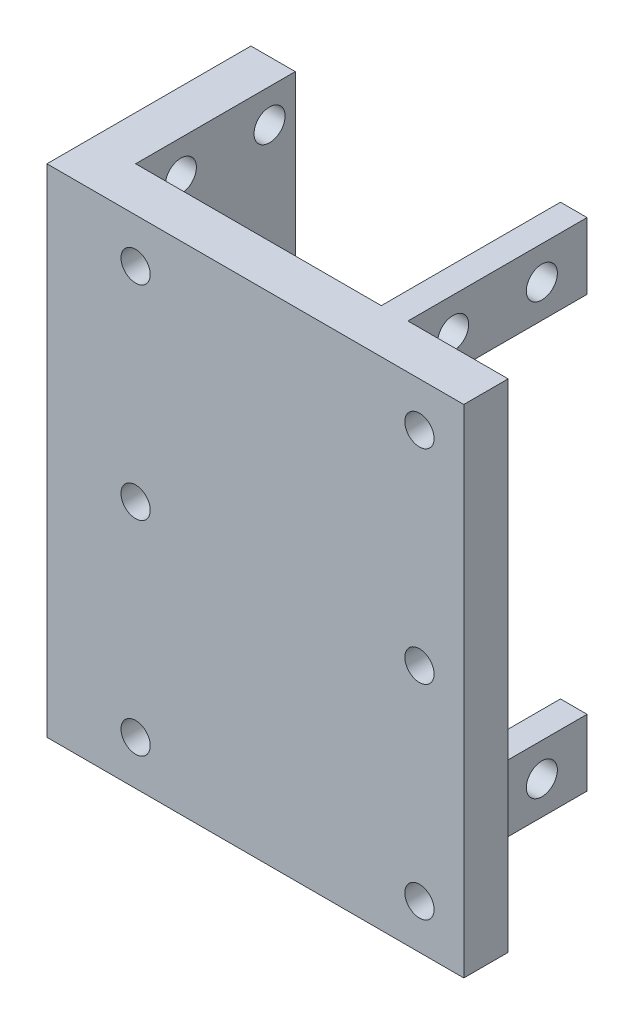
ISO-10303-21;
HEADER;
FILE_DESCRIPTION(('STEP AP214'),'2;1');
FILE_NAME('part.step','',(''),(''),'','','');
FILE_SCHEMA(('AUTOMOTIVE_DESIGN { 1 0 10303 214 1 1 1 1 }'));
ENDSEC;
DATA;
#1=APPLICATION_CONTEXT('core data for automotive mechanical design processes');
#2=APPLICATION_PROTOCOL_DEFINITION('international standard','automotive_design',2000,#1);
#3=PRODUCT_CONTEXT('',#1,'mechanical');
#4=PRODUCT('Part','Part','',(#3));
#5=PRODUCT_RELATED_PRODUCT_CATEGORY('part','',(#4));
#6=PRODUCT_DEFINITION_FORMATION('','',#4);
#7=PRODUCT_DEFINITION_CONTEXT('part definition',#1,'design');
#8=PRODUCT_DEFINITION('design','',#6,#7);
#9=PRODUCT_DEFINITION_SHAPE('','',#8);
#10=(LENGTH_UNIT() NAMED_UNIT(*) SI_UNIT(.MILLI.,.METRE.));
#11=(NAMED_UNIT(*) PLANE_ANGLE_UNIT() SI_UNIT($,.RADIAN.));
#12=(NAMED_UNIT(*) SI_UNIT($,.STERADIAN.) SOLID_ANGLE_UNIT());
#13=UNCERTAINTY_MEASURE_WITH_UNIT(LENGTH_MEASURE(1.E-05),#10,'distance_accuracy_value','');
#14=(GEOMETRIC_REPRESENTATION_CONTEXT(3) GLOBAL_UNCERTAINTY_ASSIGNED_CONTEXT((#13)) GLOBAL_UNIT_ASSIGNED_CONTEXT((#10,
#11,#12)) REPRESENTATION_CONTEXT('',''));
#15=CARTESIAN_POINT('',(0.,0.,0.));
#16=DIRECTION('',(0.,0.,1.));
#17=DIRECTION('',(1.,0.,0.));
#18=AXIS2_PLACEMENT_3D('',#15,#16,#17);
#19=CARTESIAN_POINT('',(0.,0.,0.));
#20=DIRECTION('',(0.,0.,-1.));
#21=DIRECTION('',(-1.,0.,0.));
#22=AXIS2_PLACEMENT_3D('',#19,#20,#21);
#23=PLANE('',#22);
#24=CARTESIAN_POINT('',(16.,-23.,0.));
#25=DIRECTION('',(0.,0.,-1.));
#26=DIRECTION('',(1.,0.,0.));
#27=AXIS2_PLACEMENT_3D('',#24,#25,#26);
#28=CIRCLE('',#27,1.65);
#29=CARTESIAN_POINT('',(17.65,-23.,0.));
#30=VERTEX_POINT('',#29);
#31=EDGE_CURVE('E256',#30,#30,#28,.T.);
#32=ORIENTED_EDGE('',*,*,#31,.F.);
#33=EDGE_LOOP('',(#32));
#34=FACE_BOUND('',#33,.T.);
#35=CARTESIAN_POINT('',(-16.,-23.,0.));
#36=DIRECTION('',(0.,0.,-1.));
#37=DIRECTION('',(-1.,0.,0.));
#38=AXIS2_PLACEMENT_3D('',#35,#36,#37);
#39=CIRCLE('',#38,1.65);
#40=CARTESIAN_POINT('',(-17.65,-23.,0.));
#41=VERTEX_POINT('',#40);
#42=EDGE_CURVE('E588',#41,#41,#39,.T.);
#43=ORIENTED_EDGE('',*,*,#42,.F.);
#44=EDGE_LOOP('',(#43));
#45=FACE_BOUND('',#44,.T.);
#46=CARTESIAN_POINT('',(-16.,23.,0.));
#47=DIRECTION('',(0.,0.,-1.));
#48=DIRECTION('',(1.,0.,0.));
#49=AXIS2_PLACEMENT_3D('',#46,#47,#48);
#50=CIRCLE('',#49,1.65);
#51=CARTESIAN_POINT('',(-14.35,23.,0.));
#52=VERTEX_POINT('',#51);
#53=EDGE_CURVE('E591',#52,#52,#50,.T.);
#54=ORIENTED_EDGE('',*,*,#53,.F.);
#55=EDGE_LOOP('',(#54));
#56=FACE_BOUND('',#55,.T.);
#57=CARTESIAN_POINT('',(-16.,0.,0.));
#58=DIRECTION('',(0.,0.,-1.));
#59=DIRECTION('',(-1.,0.,0.));
#60=AXIS2_PLACEMENT_3D('',#57,#58,#59);
#61=CIRCLE('',#60,1.65);
#62=CARTESIAN_POINT('',(-17.65,0.,0.));
#63=VERTEX_POINT('',#62);
#64=EDGE_CURVE('E595',#63,#63,#61,.T.);
#65=ORIENTED_EDGE('',*,*,#64,.F.);
#66=EDGE_LOOP('',(#65));
#67=FACE_BOUND('',#66,.T.);
#68=CARTESIAN_POINT('',(16.,0.,0.));
#69=DIRECTION('',(0.,0.,-1.));
#70=DIRECTION('',(1.,0.,0.));
#71=AXIS2_PLACEMENT_3D('',#68,#69,#70);
#72=CIRCLE('',#71,1.65);
#73=CARTESIAN_POINT('',(17.65,0.,0.));
#74=VERTEX_POINT('',#73);
#75=EDGE_CURVE('E274',#74,#74,#72,.T.);
#76=ORIENTED_EDGE('',*,*,#75,.F.);
#77=EDGE_LOOP('',(#76));
#78=FACE_BOUND('',#77,.T.);
#79=CARTESIAN_POINT('',(16.,23.,0.));
#80=DIRECTION('',(0.,0.,-1.));
#81=DIRECTION('',(-1.,0.,0.));
#82=AXIS2_PLACEMENT_3D('',#79,#80,#81);
#83=CIRCLE('',#82,1.65);
#84=CARTESIAN_POINT('',(14.35,23.,0.));
#85=VERTEX_POINT('',#84);
#86=EDGE_CURVE('E251',#85,#85,#83,.T.);
#87=ORIENTED_EDGE('',*,*,#86,.F.);
#88=EDGE_LOOP('',(#87));
#89=FACE_BOUND('',#88,.T.);
#90=DIRECTION('',(1.,0.,0.));
#91=VECTOR('',#90,1.);
#92=CARTESIAN_POINT('',(9.7,-20.5,0.));
#93=LINE('',#92,#91);
#94=CARTESIAN_POINT('',(6.7,-20.5,0.));
#95=VERTEX_POINT('',#94);
#96=CARTESIAN_POINT('',(9.7,-20.5,0.));
#97=VERTEX_POINT('',#96);
#98=EDGE_CURVE('E317',#95,#97,#93,.T.);
#99=ORIENTED_EDGE('',*,*,#98,.F.);
#100=DIRECTION('',(0.,1.,0.));
#101=VECTOR('',#100,1.);
#102=CARTESIAN_POINT('',(6.7,-20.5,0.));
#103=LINE('',#102,#101);
#104=CARTESIAN_POINT('',(6.7,-28.,0.));
#105=VERTEX_POINT('',#104);
#106=EDGE_CURVE('E312',#105,#95,#103,.T.);
#107=ORIENTED_EDGE('',*,*,#106,.F.);
#108=DIRECTION('',(1.,0.,0.));
#109=VECTOR('',#108,1.);
#110=CARTESIAN_POINT('',(-21.,-28.,0.));
#111=LINE('',#110,#109);
#112=CARTESIAN_POINT('',(-21.,-28.,0.));
#113=VERTEX_POINT('',#112);
#114=EDGE_CURVE('E160',#113,#105,#111,.T.);
#115=ORIENTED_EDGE('',*,*,#114,.F.);
#116=DIRECTION('',(0.,-1.,0.));
#117=VECTOR('',#116,1.);
#118=CARTESIAN_POINT('',(-21.,-28.,0.));
#119=LINE('',#118,#117);
#120=CARTESIAN_POINT('',(-21.,28.,0.));
#121=VERTEX_POINT('',#120);
#122=EDGE_CURVE('E230',#121,#113,#119,.T.);
#123=ORIENTED_EDGE('',*,*,#122,.F.);
#124=DIRECTION('',(-1.,0.,0.));
#125=VECTOR('',#124,1.);
#126=CARTESIAN_POINT('',(-21.,28.,0.));
#127=LINE('',#126,#125);
#128=CARTESIAN_POINT('',(6.7,28.,0.));
#129=VERTEX_POINT('',#128);
#130=EDGE_CURVE('E226',#129,#121,#127,.T.);
#131=ORIENTED_EDGE('',*,*,#130,.F.);
#132=DIRECTION('',(0.,1.,0.));
#133=VECTOR('',#132,1.);
#134=CARTESIAN_POINT('',(6.7,20.5,0.));
#135=LINE('',#134,#133);
#136=CARTESIAN_POINT('',(6.7,20.5,0.));
#137=VERTEX_POINT('',#136);
#138=EDGE_CURVE('E173',#137,#129,#135,.T.);
#139=ORIENTED_EDGE('',*,*,#138,.F.);
#140=DIRECTION('',(-1.,0.,0.));
#141=VECTOR('',#140,1.);
#142=CARTESIAN_POINT('',(9.7,20.5,0.));
#143=LINE('',#142,#141);
#144=CARTESIAN_POINT('',(9.7,20.5,0.));
#145=VERTEX_POINT('',#144);
#146=EDGE_CURVE('E163',#145,#137,#143,.T.);
#147=ORIENTED_EDGE('',*,*,#146,.F.);
#148=DIRECTION('',(0.,-1.,0.));
#149=VECTOR('',#148,1.);
#150=CARTESIAN_POINT('',(9.7,28.,0.));
#151=LINE('',#150,#149);
#152=CARTESIAN_POINT('',(9.7,28.,0.));
#153=VERTEX_POINT('',#152);
#154=EDGE_CURVE('E161',#153,#145,#151,.T.);
#155=ORIENTED_EDGE('',*,*,#154,.F.);
#156=CARTESIAN_POINT('',(21.,28.,0.));
#157=VERTEX_POINT('',#156);
#158=EDGE_CURVE('E227',#157,#153,#127,.T.);
#159=ORIENTED_EDGE('',*,*,#158,.F.);
#160=DIRECTION('',(0.,1.,0.));
#161=VECTOR('',#160,1.);
#162=CARTESIAN_POINT('',(21.,-28.,0.));
#163=LINE('',#162,#161);
#164=CARTESIAN_POINT('',(21.,-28.,0.));
#165=VERTEX_POINT('',#164);
#166=EDGE_CURVE('E208',#165,#157,#163,.T.);
#167=ORIENTED_EDGE('',*,*,#166,.F.);
#168=CARTESIAN_POINT('',(9.69999999999999,-28.,0.));
#169=VERTEX_POINT('',#168);
#170=EDGE_CURVE('E233',#169,#165,#111,.T.);
#171=ORIENTED_EDGE('',*,*,#170,.F.);
#172=DIRECTION('',(0.,-1.,0.));
#173=VECTOR('',#172,1.);
#174=CARTESIAN_POINT('',(9.7,-28.,0.));
#175=LINE('',#174,#173);
#176=EDGE_CURVE('E155',#97,#169,#175,.T.);
#177=ORIENTED_EDGE('',*,*,#176,.F.);
#178=EDGE_LOOP('',(#99,#107,#115,#123,#131,#139,#147,#155,#159,#167,#171,#177));
#179=FACE_BOUND('',#178,.T.);
#180=ADVANCED_FACE('F35',(#34,#45,#56,#67,#78,#89,#179),#23,.T.);
#181=CARTESIAN_POINT('',(21.,-28.,5.));
#182=DIRECTION('',(-1.,0.,0.));
#183=DIRECTION('',(0.,0.,1.));
#184=AXIS2_PLACEMENT_3D('',#181,#182,#183);
#185=PLANE('',#184);
#186=ORIENTED_EDGE('',*,*,#166,.T.);
#187=DIRECTION('',(0.,0.,-1.));
#188=VECTOR('',#187,1.);
#189=CARTESIAN_POINT('',(21.,28.,5.));
#190=LINE('',#189,#188);
#191=CARTESIAN_POINT('',(21.,28.,5.));
#192=VERTEX_POINT('',#191);
#193=EDGE_CURVE('E11',#192,#157,#190,.T.);
#194=ORIENTED_EDGE('',*,*,#193,.F.);
#195=DIRECTION('',(0.,1.,0.));
#196=VECTOR('',#195,1.);
#197=CARTESIAN_POINT('',(21.,-28.,5.));
#198=LINE('',#197,#196);
#199=CARTESIAN_POINT('',(21.,-28.,5.));
#200=VERTEX_POINT('',#199);
#201=EDGE_CURVE('E217',#200,#192,#198,.T.);
#202=ORIENTED_EDGE('',*,*,#201,.F.);
#203=DIRECTION('',(0.,0.,-1.));
#204=VECTOR('',#203,1.);
#205=CARTESIAN_POINT('',(21.,-28.,5.));
#206=LINE('',#205,#204);
#207=EDGE_CURVE('E44',#200,#165,#206,.T.);
#208=ORIENTED_EDGE('',*,*,#207,.T.);
#209=EDGE_LOOP('',(#186,#194,#202,#208));
#210=FACE_BOUND('',#209,.T.);
#211=ADVANCED_FACE('F37',(#210),#185,.F.);
#212=CARTESIAN_POINT('',(-21.,28.,5.));
#213=DIRECTION('',(0.,-1.,0.));
#214=DIRECTION('',(0.,0.,-1.));
#215=AXIS2_PLACEMENT_3D('',#212,#213,#214);
#216=PLANE('',#215);
#217=ORIENTED_EDGE('',*,*,#158,.T.);
#218=DIRECTION('',(0.,0.,1.));
#219=VECTOR('',#218,1.);
#220=CARTESIAN_POINT('',(9.7,28.,-20.2));
#221=LINE('',#220,#219);
#222=CARTESIAN_POINT('',(9.7,28.,-20.2));
#223=VERTEX_POINT('',#222);
#224=EDGE_CURVE('E188',#223,#153,#221,.T.);
#225=ORIENTED_EDGE('',*,*,#224,.F.);
#226=DIRECTION('',(1.,0.,0.));
#227=VECTOR('',#226,1.);
#228=CARTESIAN_POINT('',(6.7,28.,-20.2));
#229=LINE('',#228,#227);
#230=CARTESIAN_POINT('',(6.7,28.,-20.2));
#231=VERTEX_POINT('',#230);
#232=EDGE_CURVE('E169',#231,#223,#229,.T.);
#233=ORIENTED_EDGE('',*,*,#232,.F.);
#234=DIRECTION('',(0.,0.,1.));
#235=VECTOR('',#234,1.);
#236=CARTESIAN_POINT('',(6.7,28.,-20.2));
#237=LINE('',#236,#235);
#238=EDGE_CURVE('E178',#231,#129,#237,.T.);
#239=ORIENTED_EDGE('',*,*,#238,.T.);
#240=ORIENTED_EDGE('',*,*,#130,.T.);
#241=DIRECTION('',(0.,0.,1.));
#242=VECTOR('',#241,1.);
#243=CARTESIAN_POINT('',(-21.,28.,-18.));
#244=LINE('',#243,#242);
#245=CARTESIAN_POINT('',(-21.,28.,-18.));
#246=VERTEX_POINT('',#245);
#247=EDGE_CURVE('E203',#246,#121,#244,.T.);
#248=ORIENTED_EDGE('',*,*,#247,.F.);
#249=DIRECTION('',(-1.,0.,0.));
#250=VECTOR('',#249,1.);
#251=CARTESIAN_POINT('',(-26.,28.,-18.));
#252=LINE('',#251,#250);
#253=CARTESIAN_POINT('',(-26.,28.,-18.));
#254=VERTEX_POINT('',#253);
#255=EDGE_CURVE('E194',#246,#254,#252,.T.);
#256=ORIENTED_EDGE('',*,*,#255,.T.);
#257=DIRECTION('',(0.,0.,1.));
#258=VECTOR('',#257,1.);
#259=CARTESIAN_POINT('',(-26.,28.,-18.));
#260=LINE('',#259,#258);
#261=CARTESIAN_POINT('',(-26.,28.,5.));
#262=VERTEX_POINT('',#261);
#263=EDGE_CURVE('E212',#254,#262,#260,.T.);
#264=ORIENTED_EDGE('',*,*,#263,.T.);
#265=DIRECTION('',(-1.,0.,0.));
#266=VECTOR('',#265,1.);
#267=CARTESIAN_POINT('',(-21.,28.,5.));
#268=LINE('',#267,#266);
#269=EDGE_CURVE('E220',#192,#262,#268,.T.);
#270=ORIENTED_EDGE('',*,*,#269,.F.);
#271=ORIENTED_EDGE('',*,*,#193,.T.);
#272=EDGE_LOOP('',(#217,#225,#233,#239,#240,#248,#256,#264,#270,#271));
#273=FACE_BOUND('',#272,.T.);
#274=ADVANCED_FACE('F368',(#273),#216,.F.);
#275=CARTESIAN_POINT('',(-21.,-28.,5.));
#276=DIRECTION('',(0.,1.,0.));
#277=DIRECTION('',(0.,0.,1.));
#278=AXIS2_PLACEMENT_3D('',#275,#276,#277);
#279=PLANE('',#278);
#280=ORIENTED_EDGE('',*,*,#114,.T.);
#281=DIRECTION('',(0.,0.,1.));
#282=VECTOR('',#281,1.);
#283=CARTESIAN_POINT('',(6.7,-28.,-20.2));
#284=LINE('',#283,#282);
#285=CARTESIAN_POINT('',(6.7,-28.,-20.2));
#286=VERTEX_POINT('',#285);
#287=EDGE_CURVE('E143',#286,#105,#284,.T.);
#288=ORIENTED_EDGE('',*,*,#287,.F.);
#289=DIRECTION('',(-1.,0.,0.));
#290=VECTOR('',#289,1.);
#291=CARTESIAN_POINT('',(6.7,-28.,-20.2));
#292=LINE('',#291,#290);
#293=CARTESIAN_POINT('',(9.7,-28.,-20.2));
#294=VERTEX_POINT('',#293);
#295=EDGE_CURVE('E150',#294,#286,#292,.T.);
#296=ORIENTED_EDGE('',*,*,#295,.F.);
#297=DIRECTION('',(0.,0.,1.));
#298=VECTOR('',#297,1.);
#299=CARTESIAN_POINT('',(9.7,-28.,-20.2));
#300=LINE('',#299,#298);
#301=EDGE_CURVE('E52',#294,#169,#300,.T.);
#302=ORIENTED_EDGE('',*,*,#301,.T.);
#303=ORIENTED_EDGE('',*,*,#170,.T.);
#304=ORIENTED_EDGE('',*,*,#207,.F.);
#305=DIRECTION('',(1.,0.,0.));
#306=VECTOR('',#305,1.);
#307=CARTESIAN_POINT('',(-21.,-28.,5.));
#308=LINE('',#307,#306);
#309=CARTESIAN_POINT('',(-26.,-28.,5.));
#310=VERTEX_POINT('',#309);
#311=EDGE_CURVE('E222',#310,#200,#308,.T.);
#312=ORIENTED_EDGE('',*,*,#311,.F.);
#313=DIRECTION('',(0.,0.,1.));
#314=VECTOR('',#313,1.);
#315=CARTESIAN_POINT('',(-26.,-28.,-18.));
#316=LINE('',#315,#314);
#317=CARTESIAN_POINT('',(-26.,-28.,-18.));
#318=VERTEX_POINT('',#317);
#319=EDGE_CURVE('E209',#318,#310,#316,.T.);
#320=ORIENTED_EDGE('',*,*,#319,.F.);
#321=DIRECTION('',(1.,0.,0.));
#322=VECTOR('',#321,1.);
#323=CARTESIAN_POINT('',(-26.,-28.,-18.));
#324=LINE('',#323,#322);
#325=CARTESIAN_POINT('',(-21.,-28.,-18.));
#326=VERTEX_POINT('',#325);
#327=EDGE_CURVE('E200',#318,#326,#324,.T.);
#328=ORIENTED_EDGE('',*,*,#327,.T.);
#329=DIRECTION('',(0.,0.,1.));
#330=VECTOR('',#329,1.);
#331=CARTESIAN_POINT('',(-21.,-28.,-18.));
#332=LINE('',#331,#330);
#333=EDGE_CURVE('E206',#326,#113,#332,.T.);
#334=ORIENTED_EDGE('',*,*,#333,.T.);
#335=EDGE_LOOP('',(#280,#288,#296,#302,#303,#304,#312,#320,#328,#334));
#336=FACE_BOUND('',#335,.T.);
#337=ADVANCED_FACE('F158',(#336),#279,.F.);
#338=CARTESIAN_POINT('',(0.,0.,5.));
#339=DIRECTION('',(0.,0.,-1.));
#340=DIRECTION('',(-1.,0.,0.));
#341=AXIS2_PLACEMENT_3D('',#338,#339,#340);
#342=PLANE('',#341);
#343=CARTESIAN_POINT('',(16.,-23.,5.));
#344=DIRECTION('',(0.,0.,-1.));
#345=DIRECTION('',(-1.,0.,0.));
#346=AXIS2_PLACEMENT_3D('',#343,#344,#345);
#347=CIRCLE('',#346,1.65);
#348=CARTESIAN_POINT('',(14.35,-23.,5.));
#349=VERTEX_POINT('',#348);
#350=EDGE_CURVE('E39',#349,#349,#347,.T.);
#351=ORIENTED_EDGE('',*,*,#350,.T.);
#352=EDGE_LOOP('',(#351));
#353=FACE_BOUND('',#352,.T.);
#354=CARTESIAN_POINT('',(-16.,-23.,5.));
#355=DIRECTION('',(0.,0.,-1.));
#356=DIRECTION('',(-1.,0.,0.));
#357=AXIS2_PLACEMENT_3D('',#354,#355,#356);
#358=CIRCLE('',#357,1.65);
#359=CARTESIAN_POINT('',(-17.65,-23.,5.));
#360=VERTEX_POINT('',#359);
#361=EDGE_CURVE('E261',#360,#360,#358,.T.);
#362=ORIENTED_EDGE('',*,*,#361,.T.);
#363=EDGE_LOOP('',(#362));
#364=FACE_BOUND('',#363,.T.);
#365=CARTESIAN_POINT('',(-16.,23.,5.));
#366=DIRECTION('',(0.,0.,-1.));
#367=DIRECTION('',(-1.,0.,0.));
#368=AXIS2_PLACEMENT_3D('',#365,#366,#367);
#369=CIRCLE('',#368,1.65);
#370=CARTESIAN_POINT('',(-17.65,23.,5.));
#371=VERTEX_POINT('',#370);
#372=EDGE_CURVE('E259',#371,#371,#369,.T.);
#373=ORIENTED_EDGE('',*,*,#372,.T.);
#374=EDGE_LOOP('',(#373));
#375=FACE_BOUND('',#374,.T.);
#376=CARTESIAN_POINT('',(-16.,0.,5.));
#377=DIRECTION('',(0.,0.,-1.));
#378=DIRECTION('',(-1.,0.,0.));
#379=AXIS2_PLACEMENT_3D('',#376,#377,#378);
#380=CIRCLE('',#379,1.65);
#381=CARTESIAN_POINT('',(-17.65,0.,5.));
#382=VERTEX_POINT('',#381);
#383=EDGE_CURVE('E255',#382,#382,#380,.T.);
#384=ORIENTED_EDGE('',*,*,#383,.T.);
#385=EDGE_LOOP('',(#384));
#386=FACE_BOUND('',#385,.T.);
#387=CARTESIAN_POINT('',(16.,0.,5.));
#388=DIRECTION('',(0.,0.,-1.));
#389=DIRECTION('',(-1.,0.,0.));
#390=AXIS2_PLACEMENT_3D('',#387,#388,#389);
#391=CIRCLE('',#390,1.65);
#392=CARTESIAN_POINT('',(14.35,0.,5.));
#393=VERTEX_POINT('',#392);
#394=EDGE_CURVE('E252',#393,#393,#391,.T.);
#395=ORIENTED_EDGE('',*,*,#394,.T.);
#396=EDGE_LOOP('',(#395));
#397=FACE_BOUND('',#396,.T.);
#398=CARTESIAN_POINT('',(16.,23.,5.));
#399=DIRECTION('',(0.,0.,-1.));
#400=DIRECTION('',(-1.,0.,0.));
#401=AXIS2_PLACEMENT_3D('',#398,#399,#400);
#402=CIRCLE('',#401,1.65);
#403=CARTESIAN_POINT('',(14.35,23.,5.));
#404=VERTEX_POINT('',#403);
#405=EDGE_CURVE('E247',#404,#404,#402,.T.);
#406=ORIENTED_EDGE('',*,*,#405,.T.);
#407=EDGE_LOOP('',(#406));
#408=FACE_BOUND('',#407,.T.);
#409=ORIENTED_EDGE('',*,*,#201,.T.);
#410=ORIENTED_EDGE('',*,*,#269,.T.);
#411=DIRECTION('',(0.,-1.,0.));
#412=VECTOR('',#411,1.);
#413=CARTESIAN_POINT('',(-26.,-28.,5.));
#414=LINE('',#413,#412);
#415=EDGE_CURVE('E190',#262,#310,#414,.T.);
#416=ORIENTED_EDGE('',*,*,#415,.T.);
#417=ORIENTED_EDGE('',*,*,#311,.T.);
#418=EDGE_LOOP('',(#409,#410,#416,#417));
#419=FACE_BOUND('',#418,.T.);
#420=ADVANCED_FACE('F335',(#353,#364,#375,#386,#397,#408,#419),#342,.F.);
#421=CARTESIAN_POINT('',(-21.,-28.,-18.));
#422=DIRECTION('',(1.,0.,0.));
#423=DIRECTION('',(0.,0.,-1.));
#424=AXIS2_PLACEMENT_3D('',#421,#422,#423);
#425=PLANE('',#424);
#426=CARTESIAN_POINT('',(-21.,24.25,-15.1));
#427=DIRECTION('',(1.,0.,0.));
#428=DIRECTION('',(0.,0.,-1.));
#429=AXIS2_PLACEMENT_3D('',#426,#427,#428);
#430=CIRCLE('',#429,1.75);
#431=CARTESIAN_POINT('',(-21.,24.25,-16.85));
#432=VERTEX_POINT('',#431);
#433=EDGE_CURVE('E245',#432,#432,#430,.T.);
#434=ORIENTED_EDGE('',*,*,#433,.F.);
#435=EDGE_LOOP('',(#434));
#436=FACE_BOUND('',#435,.T.);
#437=CARTESIAN_POINT('',(-21.,-24.25,-15.1));
#438=DIRECTION('',(1.,0.,0.));
#439=DIRECTION('',(0.,0.,-1.));
#440=AXIS2_PLACEMENT_3D('',#437,#438,#439);
#441=CIRCLE('',#440,1.75);
#442=CARTESIAN_POINT('',(-21.,-24.25,-16.85));
#443=VERTEX_POINT('',#442);
#444=EDGE_CURVE('E246',#443,#443,#441,.T.);
#445=ORIENTED_EDGE('',*,*,#444,.F.);
#446=EDGE_LOOP('',(#445));
#447=FACE_BOUND('',#446,.T.);
#448=CARTESIAN_POINT('',(-21.,-24.25,-5.1));
#449=DIRECTION('',(1.,0.,0.));
#450=DIRECTION('',(0.,0.,-1.));
#451=AXIS2_PLACEMENT_3D('',#448,#449,#450);
#452=CIRCLE('',#451,1.75);
#453=CARTESIAN_POINT('',(-21.,-24.25,-6.85));
#454=VERTEX_POINT('',#453);
#455=EDGE_CURVE('E296',#454,#454,#452,.T.);
#456=ORIENTED_EDGE('',*,*,#455,.F.);
#457=EDGE_LOOP('',(#456));
#458=FACE_BOUND('',#457,.T.);
#459=CARTESIAN_POINT('',(-21.,24.25,-5.1));
#460=DIRECTION('',(1.,0.,0.));
#461=DIRECTION('',(0.,0.,-1.));
#462=AXIS2_PLACEMENT_3D('',#459,#460,#461);
#463=CIRCLE('',#462,1.75);
#464=CARTESIAN_POINT('',(-21.,24.25,-6.85));
#465=VERTEX_POINT('',#464);
#466=EDGE_CURVE('E240',#465,#465,#463,.T.);
#467=ORIENTED_EDGE('',*,*,#466,.F.);
#468=EDGE_LOOP('',(#467));
#469=FACE_BOUND('',#468,.T.);
#470=ORIENTED_EDGE('',*,*,#247,.T.);
#471=ORIENTED_EDGE('',*,*,#122,.T.);
#472=ORIENTED_EDGE('',*,*,#333,.F.);
#473=DIRECTION('',(0.,1.,0.));
#474=VECTOR('',#473,1.);
#475=CARTESIAN_POINT('',(-21.,-28.,-18.));
#476=LINE('',#475,#474);
#477=EDGE_CURVE('E191',#326,#246,#476,.T.);
#478=ORIENTED_EDGE('',*,*,#477,.T.);
#479=EDGE_LOOP('',(#470,#471,#472,#478));
#480=FACE_BOUND('',#479,.T.);
#481=ADVANCED_FACE('F346',(#436,#447,#458,#469,#480),#425,.T.);
#482=CARTESIAN_POINT('',(-26.,-28.,-18.));
#483=DIRECTION('',(-1.,0.,0.));
#484=DIRECTION('',(0.,-1.,0.));
#485=AXIS2_PLACEMENT_3D('',#482,#483,#484);
#486=PLANE('',#485);
#487=CARTESIAN_POINT('',(-26.,24.25,-15.1));
#488=DIRECTION('',(1.,0.,0.));
#489=DIRECTION('',(0.,0.,1.));
#490=AXIS2_PLACEMENT_3D('',#487,#488,#489);
#491=CIRCLE('',#490,1.75);
#492=CARTESIAN_POINT('',(-26.,24.25,-13.35));
#493=VERTEX_POINT('',#492);
#494=EDGE_CURVE('E276',#493,#493,#491,.T.);
#495=ORIENTED_EDGE('',*,*,#494,.T.);
#496=EDGE_LOOP('',(#495));
#497=FACE_BOUND('',#496,.T.);
#498=CARTESIAN_POINT('',(-26.,-24.25,-15.1));
#499=DIRECTION('',(1.,0.,0.));
#500=DIRECTION('',(0.,0.,-1.));
#501=AXIS2_PLACEMENT_3D('',#498,#499,#500);
#502=CIRCLE('',#501,1.75);
#503=CARTESIAN_POINT('',(-26.,-24.25,-16.85));
#504=VERTEX_POINT('',#503);
#505=EDGE_CURVE('E283',#504,#504,#502,.T.);
#506=ORIENTED_EDGE('',*,*,#505,.T.);
#507=EDGE_LOOP('',(#506));
#508=FACE_BOUND('',#507,.T.);
#509=CARTESIAN_POINT('',(-26.,-24.25,-5.1));
#510=DIRECTION('',(1.,0.,0.));
#511=DIRECTION('',(0.,0.,1.));
#512=AXIS2_PLACEMENT_3D('',#509,#510,#511);
#513=CIRCLE('',#512,1.75);
#514=CARTESIAN_POINT('',(-26.,-24.25,-3.35));
#515=VERTEX_POINT('',#514);
#516=EDGE_CURVE('E289',#515,#515,#513,.T.);
#517=ORIENTED_EDGE('',*,*,#516,.T.);
#518=EDGE_LOOP('',(#517));
#519=FACE_BOUND('',#518,.T.);
#520=CARTESIAN_POINT('',(-26.,24.25,-5.1));
#521=DIRECTION('',(1.,0.,0.));
#522=DIRECTION('',(0.,0.,-1.));
#523=AXIS2_PLACEMENT_3D('',#520,#521,#522);
#524=CIRCLE('',#523,1.75);
#525=CARTESIAN_POINT('',(-26.,24.25,-6.85));
#526=VERTEX_POINT('',#525);
#527=EDGE_CURVE('E241',#526,#526,#524,.T.);
#528=ORIENTED_EDGE('',*,*,#527,.T.);
#529=EDGE_LOOP('',(#528));
#530=FACE_BOUND('',#529,.T.);
#531=ORIENTED_EDGE('',*,*,#415,.F.);
#532=ORIENTED_EDGE('',*,*,#263,.F.);
#533=DIRECTION('',(0.,-1.,0.));
#534=VECTOR('',#533,1.);
#535=CARTESIAN_POINT('',(-26.,-28.,-18.));
#536=LINE('',#535,#534);
#537=EDGE_CURVE('E197',#254,#318,#536,.T.);
#538=ORIENTED_EDGE('',*,*,#537,.T.);
#539=ORIENTED_EDGE('',*,*,#319,.T.);
#540=EDGE_LOOP('',(#531,#532,#538,#539));
#541=FACE_BOUND('',#540,.T.);
#542=ADVANCED_FACE('F338',(#497,#508,#519,#530,#541),#486,.T.);
#543=CARTESIAN_POINT('',(0.,0.,-18.));
#544=DIRECTION('',(0.,0.,-1.));
#545=DIRECTION('',(-1.,0.,0.));
#546=AXIS2_PLACEMENT_3D('',#543,#544,#545);
#547=PLANE('',#546);
#548=ORIENTED_EDGE('',*,*,#477,.F.);
#549=ORIENTED_EDGE('',*,*,#327,.F.);
#550=ORIENTED_EDGE('',*,*,#537,.F.);
#551=ORIENTED_EDGE('',*,*,#255,.F.);
#552=EDGE_LOOP('',(#548,#549,#550,#551));
#553=FACE_BOUND('',#552,.T.);
#554=ADVANCED_FACE('F344',(#553),#547,.T.);
#555=CARTESIAN_POINT('',(9.7,28.,-20.2));
#556=DIRECTION('',(-1.,0.,0.));
#557=DIRECTION('',(0.,-1.,0.));
#558=AXIS2_PLACEMENT_3D('',#555,#556,#557);
#559=PLANE('',#558);
#560=CARTESIAN_POINT('',(9.69999999999999,24.25,-15.1));
#561=DIRECTION('',(1.,0.,0.));
#562=DIRECTION('',(0.,0.,1.));
#563=AXIS2_PLACEMENT_3D('',#560,#561,#562);
#564=CIRCLE('',#563,1.75);
#565=CARTESIAN_POINT('',(9.69999999999999,24.25,-13.35));
#566=VERTEX_POINT('',#565);
#567=EDGE_CURVE('E280',#566,#566,#564,.T.);
#568=ORIENTED_EDGE('',*,*,#567,.F.);
#569=EDGE_LOOP('',(#568));
#570=FACE_BOUND('',#569,.T.);
#571=CARTESIAN_POINT('',(9.69999999999999,24.25,-5.1));
#572=DIRECTION('',(1.,0.,0.));
#573=DIRECTION('',(0.,0.,-1.));
#574=AXIS2_PLACEMENT_3D('',#571,#572,#573);
#575=CIRCLE('',#574,1.75);
#576=CARTESIAN_POINT('',(9.69999999999999,24.25,-6.85));
#577=VERTEX_POINT('',#576);
#578=EDGE_CURVE('E306',#577,#577,#575,.T.);
#579=ORIENTED_EDGE('',*,*,#578,.F.);
#580=EDGE_LOOP('',(#579));
#581=FACE_BOUND('',#580,.T.);
#582=ORIENTED_EDGE('',*,*,#154,.T.);
#583=DIRECTION('',(0.,0.,1.));
#584=VECTOR('',#583,1.);
#585=CARTESIAN_POINT('',(9.7,20.5,-20.2));
#586=LINE('',#585,#584);
#587=CARTESIAN_POINT('',(9.7,20.5,-20.2));
#588=VERTEX_POINT('',#587);
#589=EDGE_CURVE('E185',#588,#145,#586,.T.);
#590=ORIENTED_EDGE('',*,*,#589,.F.);
#591=DIRECTION('',(0.,-1.,0.));
#592=VECTOR('',#591,1.);
#593=CARTESIAN_POINT('',(9.7,28.,-20.2));
#594=LINE('',#593,#592);
#595=EDGE_CURVE('E172',#223,#588,#594,.T.);
#596=ORIENTED_EDGE('',*,*,#595,.F.);
#597=ORIENTED_EDGE('',*,*,#224,.T.);
#598=EDGE_LOOP('',(#582,#590,#596,#597));
#599=FACE_BOUND('',#598,.T.);
#600=ADVANCED_FACE('F385',(#570,#581,#599),#559,.F.);
#601=CARTESIAN_POINT('',(9.7,20.5,-20.2));
#602=DIRECTION('',(0.,1.,0.));
#603=DIRECTION('',(0.,0.,1.));
#604=AXIS2_PLACEMENT_3D('',#601,#602,#603);
#605=PLANE('',#604);
#606=ORIENTED_EDGE('',*,*,#146,.T.);
#607=DIRECTION('',(0.,0.,1.));
#608=VECTOR('',#607,1.);
#609=CARTESIAN_POINT('',(6.7,20.5,-20.2));
#610=LINE('',#609,#608);
#611=CARTESIAN_POINT('',(6.7,20.5,-20.2));
#612=VERTEX_POINT('',#611);
#613=EDGE_CURVE('E60',#612,#137,#610,.T.);
#614=ORIENTED_EDGE('',*,*,#613,.F.);
#615=DIRECTION('',(-1.,0.,0.));
#616=VECTOR('',#615,1.);
#617=CARTESIAN_POINT('',(9.7,20.5,-20.2));
#618=LINE('',#617,#616);
#619=EDGE_CURVE('E175',#588,#612,#618,.T.);
#620=ORIENTED_EDGE('',*,*,#619,.F.);
#621=ORIENTED_EDGE('',*,*,#589,.T.);
#622=EDGE_LOOP('',(#606,#614,#620,#621));
#623=FACE_BOUND('',#622,.T.);
#624=ADVANCED_FACE('F388',(#623),#605,.F.);
#625=CARTESIAN_POINT('',(6.7,20.5,-20.2));
#626=DIRECTION('',(1.,0.,0.));
#627=DIRECTION('',(0.,1.,0.));
#628=AXIS2_PLACEMENT_3D('',#625,#626,#627);
#629=PLANE('',#628);
#630=CARTESIAN_POINT('',(6.7,24.25,-15.1));
#631=DIRECTION('',(1.,0.,0.));
#632=DIRECTION('',(0.,1.,0.));
#633=AXIS2_PLACEMENT_3D('',#630,#631,#632);
#634=CIRCLE('',#633,1.75);
#635=CARTESIAN_POINT('',(6.7,26.,-15.1));
#636=VERTEX_POINT('',#635);
#637=EDGE_CURVE('E242',#636,#636,#634,.T.);
#638=ORIENTED_EDGE('',*,*,#637,.T.);
#639=EDGE_LOOP('',(#638));
#640=FACE_BOUND('',#639,.T.);
#641=CARTESIAN_POINT('',(6.7,24.25,-5.1));
#642=DIRECTION('',(1.,0.,0.));
#643=DIRECTION('',(0.,1.,0.));
#644=AXIS2_PLACEMENT_3D('',#641,#642,#643);
#645=CIRCLE('',#644,1.75);
#646=CARTESIAN_POINT('',(6.7,26.,-5.1));
#647=VERTEX_POINT('',#646);
#648=EDGE_CURVE('E237',#647,#647,#645,.T.);
#649=ORIENTED_EDGE('',*,*,#648,.T.);
#650=EDGE_LOOP('',(#649));
#651=FACE_BOUND('',#650,.T.);
#652=ORIENTED_EDGE('',*,*,#138,.T.);
#653=ORIENTED_EDGE('',*,*,#238,.F.);
#654=DIRECTION('',(0.,1.,0.));
#655=VECTOR('',#654,1.);
#656=CARTESIAN_POINT('',(6.7,20.5,-20.2));
#657=LINE('',#656,#655);
#658=EDGE_CURVE('E177',#612,#231,#657,.T.);
#659=ORIENTED_EDGE('',*,*,#658,.F.);
#660=ORIENTED_EDGE('',*,*,#613,.T.);
#661=EDGE_LOOP('',(#652,#653,#659,#660));
#662=FACE_BOUND('',#661,.T.);
#663=ADVANCED_FACE('F391',(#640,#651,#662),#629,.F.);
#664=CARTESIAN_POINT('',(0.,0.,-20.2));
#665=DIRECTION('',(0.,0.,-1.));
#666=DIRECTION('',(-1.,0.,0.));
#667=AXIS2_PLACEMENT_3D('',#664,#665,#666);
#668=PLANE('',#667);
#669=ORIENTED_EDGE('',*,*,#232,.T.);
#670=ORIENTED_EDGE('',*,*,#595,.T.);
#671=ORIENTED_EDGE('',*,*,#619,.T.);
#672=ORIENTED_EDGE('',*,*,#658,.T.);
#673=EDGE_LOOP('',(#669,#670,#671,#672));
#674=FACE_BOUND('',#673,.T.);
#675=ADVANCED_FACE('F359',(#674),#668,.T.);
#676=CARTESIAN_POINT('',(6.7,-20.5,-20.2));
#677=DIRECTION('',(1.,0.,0.));
#678=DIRECTION('',(0.,0.,-1.));
#679=AXIS2_PLACEMENT_3D('',#676,#677,#678);
#680=PLANE('',#679);
#681=CARTESIAN_POINT('',(6.7,-24.25,-15.1));
#682=DIRECTION('',(1.,0.,0.));
#683=DIRECTION('',(0.,0.,-1.));
#684=AXIS2_PLACEMENT_3D('',#681,#682,#683);
#685=CIRCLE('',#684,1.75);
#686=CARTESIAN_POINT('',(6.7,-24.25,-16.85));
#687=VERTEX_POINT('',#686);
#688=EDGE_CURVE('E299',#687,#687,#685,.T.);
#689=ORIENTED_EDGE('',*,*,#688,.T.);
#690=EDGE_LOOP('',(#689));
#691=FACE_BOUND('',#690,.T.);
#692=CARTESIAN_POINT('',(6.7,-24.25,-5.1));
#693=DIRECTION('',(1.,0.,0.));
#694=DIRECTION('',(0.,0.,-1.));
#695=AXIS2_PLACEMENT_3D('',#692,#693,#694);
#696=CIRCLE('',#695,1.75);
#697=CARTESIAN_POINT('',(6.7,-24.25,-6.85));
#698=VERTEX_POINT('',#697);
#699=EDGE_CURVE('E279',#698,#698,#696,.T.);
#700=ORIENTED_EDGE('',*,*,#699,.T.);
#701=EDGE_LOOP('',(#700));
#702=FACE_BOUND('',#701,.T.);
#703=ORIENTED_EDGE('',*,*,#106,.T.);
#704=DIRECTION('',(0.,0.,1.));
#705=VECTOR('',#704,1.);
#706=CARTESIAN_POINT('',(6.7,-20.5,-20.2));
#707=LINE('',#706,#705);
#708=CARTESIAN_POINT('',(6.7,-20.5,-20.2));
#709=VERTEX_POINT('',#708);
#710=EDGE_CURVE('E146',#709,#95,#707,.T.);
#711=ORIENTED_EDGE('',*,*,#710,.F.);
#712=DIRECTION('',(0.,1.,0.));
#713=VECTOR('',#712,1.);
#714=CARTESIAN_POINT('',(6.7,-20.5,-20.2));
#715=LINE('',#714,#713);
#716=EDGE_CURVE('E139',#286,#709,#715,.T.);
#717=ORIENTED_EDGE('',*,*,#716,.F.);
#718=ORIENTED_EDGE('',*,*,#287,.T.);
#719=EDGE_LOOP('',(#703,#711,#717,#718));
#720=FACE_BOUND('',#719,.T.);
#721=ADVANCED_FACE('F141',(#691,#702,#720),#680,.F.);
#722=CARTESIAN_POINT('',(9.7,-20.5,-20.2));
#723=DIRECTION('',(0.,-1.,0.));
#724=DIRECTION('',(0.,0.,-1.));
#725=AXIS2_PLACEMENT_3D('',#722,#723,#724);
#726=PLANE('',#725);
#727=ORIENTED_EDGE('',*,*,#98,.T.);
#728=DIRECTION('',(0.,0.,1.));
#729=VECTOR('',#728,1.);
#730=CARTESIAN_POINT('',(9.7,-20.5,-20.2));
#731=LINE('',#730,#729);
#732=CARTESIAN_POINT('',(9.7,-20.5,-20.2));
#733=VERTEX_POINT('',#732);
#734=EDGE_CURVE('E165',#733,#97,#731,.T.);
#735=ORIENTED_EDGE('',*,*,#734,.F.);
#736=DIRECTION('',(1.,0.,0.));
#737=VECTOR('',#736,1.);
#738=CARTESIAN_POINT('',(9.7,-20.5,-20.2));
#739=LINE('',#738,#737);
#740=EDGE_CURVE('E149',#709,#733,#739,.T.);
#741=ORIENTED_EDGE('',*,*,#740,.F.);
#742=ORIENTED_EDGE('',*,*,#710,.T.);
#743=EDGE_LOOP('',(#727,#735,#741,#742));
#744=FACE_BOUND('',#743,.T.);
#745=ADVANCED_FACE('F350',(#744),#726,.F.);
#746=CARTESIAN_POINT('',(9.7,-28.,-20.2));
#747=DIRECTION('',(-1.,0.,0.));
#748=DIRECTION('',(0.,0.,1.));
#749=AXIS2_PLACEMENT_3D('',#746,#747,#748);
#750=PLANE('',#749);
#751=CARTESIAN_POINT('',(9.69999999999999,-24.25,-15.1));
#752=DIRECTION('',(1.,0.,0.));
#753=DIRECTION('',(0.,0.,-1.));
#754=AXIS2_PLACEMENT_3D('',#751,#752,#753);
#755=CIRCLE('',#754,1.75);
#756=CARTESIAN_POINT('',(9.69999999999999,-24.25,-16.85));
#757=VERTEX_POINT('',#756);
#758=EDGE_CURVE('E286',#757,#757,#755,.T.);
#759=ORIENTED_EDGE('',*,*,#758,.F.);
#760=EDGE_LOOP('',(#759));
#761=FACE_BOUND('',#760,.T.);
#762=CARTESIAN_POINT('',(9.69999999999999,-24.25,-5.1));
#763=DIRECTION('',(1.,0.,0.));
#764=DIRECTION('',(0.,0.,1.));
#765=AXIS2_PLACEMENT_3D('',#762,#763,#764);
#766=CIRCLE('',#765,1.75);
#767=CARTESIAN_POINT('',(9.69999999999999,-24.25,-3.35));
#768=VERTEX_POINT('',#767);
#769=EDGE_CURVE('E250',#768,#768,#766,.T.);
#770=ORIENTED_EDGE('',*,*,#769,.F.);
#771=EDGE_LOOP('',(#770));
#772=FACE_BOUND('',#771,.T.);
#773=ORIENTED_EDGE('',*,*,#176,.T.);
#774=ORIENTED_EDGE('',*,*,#301,.F.);
#775=DIRECTION('',(0.,-1.,0.));
#776=VECTOR('',#775,1.);
#777=CARTESIAN_POINT('',(9.7,-28.,-20.2));
#778=LINE('',#777,#776);
#779=EDGE_CURVE('E154',#733,#294,#778,.T.);
#780=ORIENTED_EDGE('',*,*,#779,.F.);
#781=ORIENTED_EDGE('',*,*,#734,.T.);
#782=EDGE_LOOP('',(#773,#774,#780,#781));
#783=FACE_BOUND('',#782,.T.);
#784=ADVANCED_FACE('F324',(#761,#772,#783),#750,.F.);
#785=CARTESIAN_POINT('',(0.,0.,-20.2));
#786=DIRECTION('',(0.,0.,1.));
#787=DIRECTION('',(1.,0.,0.));
#788=AXIS2_PLACEMENT_3D('',#785,#786,#787);
#789=PLANE('',#788);
#790=ORIENTED_EDGE('',*,*,#295,.T.);
#791=ORIENTED_EDGE('',*,*,#716,.T.);
#792=ORIENTED_EDGE('',*,*,#740,.T.);
#793=ORIENTED_EDGE('',*,*,#779,.T.);
#794=EDGE_LOOP('',(#790,#791,#792,#793));
#795=FACE_BOUND('',#794,.T.);
#796=ADVANCED_FACE('F152',(#795),#789,.F.);
#797=CARTESIAN_POINT('',(-26.,24.25,-5.1));
#798=DIRECTION('',(1.,0.,0.));
#799=DIRECTION('',(0.,0.,-1.));
#800=AXIS2_PLACEMENT_3D('',#797,#798,#799);
#801=CYLINDRICAL_SURFACE('',#800,1.75);
#802=ORIENTED_EDGE('',*,*,#578,.T.);
#803=EDGE_LOOP('',(#802));
#804=FACE_BOUND('',#803,.T.);
#805=ORIENTED_EDGE('',*,*,#648,.F.);
#806=EDGE_LOOP('',(#805));
#807=FACE_BOUND('',#806,.T.);
#808=ADVANCED_FACE('F427',(#804,#807),#801,.F.);
#809=ORIENTED_EDGE('',*,*,#466,.T.);
#810=EDGE_LOOP('',(#809));
#811=FACE_BOUND('',#810,.T.);
#812=ORIENTED_EDGE('',*,*,#527,.F.);
#813=EDGE_LOOP('',(#812));
#814=FACE_BOUND('',#813,.T.);
#815=ADVANCED_FACE('F423',(#811,#814),#801,.F.);
#816=CARTESIAN_POINT('',(-26.,-24.25,-5.1));
#817=DIRECTION('',(1.,0.,0.));
#818=DIRECTION('',(0.,0.,-1.));
#819=AXIS2_PLACEMENT_3D('',#816,#817,#818);
#820=CYLINDRICAL_SURFACE('',#819,1.75);
#821=ORIENTED_EDGE('',*,*,#769,.T.);
#822=EDGE_LOOP('',(#821));
#823=FACE_BOUND('',#822,.T.);
#824=ORIENTED_EDGE('',*,*,#699,.F.);
#825=EDGE_LOOP('',(#824));
#826=FACE_BOUND('',#825,.T.);
#827=ADVANCED_FACE('F426',(#823,#826),#820,.F.);
#828=CARTESIAN_POINT('',(-26.,-24.25,-15.1));
#829=DIRECTION('',(1.,0.,0.));
#830=DIRECTION('',(0.,0.,-1.));
#831=AXIS2_PLACEMENT_3D('',#828,#829,#830);
#832=CYLINDRICAL_SURFACE('',#831,1.75);
#833=ORIENTED_EDGE('',*,*,#758,.T.);
#834=EDGE_LOOP('',(#833));
#835=FACE_BOUND('',#834,.T.);
#836=ORIENTED_EDGE('',*,*,#688,.F.);
#837=EDGE_LOOP('',(#836));
#838=FACE_BOUND('',#837,.T.);
#839=ADVANCED_FACE('F435',(#835,#838),#832,.F.);
#840=CARTESIAN_POINT('',(-26.,24.25,-15.1));
#841=DIRECTION('',(1.,0.,0.));
#842=DIRECTION('',(0.,0.,-1.));
#843=AXIS2_PLACEMENT_3D('',#840,#841,#842);
#844=CYLINDRICAL_SURFACE('',#843,1.75);
#845=ORIENTED_EDGE('',*,*,#567,.T.);
#846=EDGE_LOOP('',(#845));
#847=FACE_BOUND('',#846,.T.);
#848=ORIENTED_EDGE('',*,*,#637,.F.);
#849=EDGE_LOOP('',(#848));
#850=FACE_BOUND('',#849,.T.);
#851=ADVANCED_FACE('F473',(#847,#850),#844,.F.);
#852=ORIENTED_EDGE('',*,*,#455,.T.);
#853=EDGE_LOOP('',(#852));
#854=FACE_BOUND('',#853,.T.);
#855=ORIENTED_EDGE('',*,*,#516,.F.);
#856=EDGE_LOOP('',(#855));
#857=FACE_BOUND('',#856,.T.);
#858=ADVANCED_FACE('F438',(#854,#857),#820,.F.);
#859=ORIENTED_EDGE('',*,*,#444,.T.);
#860=EDGE_LOOP('',(#859));
#861=FACE_BOUND('',#860,.T.);
#862=ORIENTED_EDGE('',*,*,#505,.F.);
#863=EDGE_LOOP('',(#862));
#864=FACE_BOUND('',#863,.T.);
#865=ADVANCED_FACE('F475',(#861,#864),#832,.F.);
#866=ORIENTED_EDGE('',*,*,#433,.T.);
#867=EDGE_LOOP('',(#866));
#868=FACE_BOUND('',#867,.T.);
#869=ORIENTED_EDGE('',*,*,#494,.F.);
#870=EDGE_LOOP('',(#869));
#871=FACE_BOUND('',#870,.T.);
#872=ADVANCED_FACE('F485',(#868,#871),#844,.F.);
#873=CARTESIAN_POINT('',(16.,23.,10.));
#874=DIRECTION('',(0.,0.,-1.));
#875=DIRECTION('',(-1.,0.,0.));
#876=AXIS2_PLACEMENT_3D('',#873,#874,#875);
#877=CYLINDRICAL_SURFACE('',#876,1.65);
#878=ORIENTED_EDGE('',*,*,#86,.T.);
#879=EDGE_LOOP('',(#878));
#880=FACE_BOUND('',#879,.T.);
#881=ORIENTED_EDGE('',*,*,#405,.F.);
#882=EDGE_LOOP('',(#881));
#883=FACE_BOUND('',#882,.T.);
#884=ADVANCED_FACE('F508',(#880,#883),#877,.F.);
#885=CARTESIAN_POINT('',(16.,0.,10.));
#886=DIRECTION('',(0.,0.,-1.));
#887=DIRECTION('',(-1.,0.,0.));
#888=AXIS2_PLACEMENT_3D('',#885,#886,#887);
#889=CYLINDRICAL_SURFACE('',#888,1.65);
#890=ORIENTED_EDGE('',*,*,#75,.T.);
#891=EDGE_LOOP('',(#890));
#892=FACE_BOUND('',#891,.T.);
#893=ORIENTED_EDGE('',*,*,#394,.F.);
#894=EDGE_LOOP('',(#893));
#895=FACE_BOUND('',#894,.T.);
#896=ADVANCED_FACE('F533',(#892,#895),#889,.F.);
#897=CARTESIAN_POINT('',(-16.,0.,10.));
#898=DIRECTION('',(0.,0.,-1.));
#899=DIRECTION('',(-1.,0.,0.));
#900=AXIS2_PLACEMENT_3D('',#897,#898,#899);
#901=CYLINDRICAL_SURFACE('',#900,1.65);
#902=ORIENTED_EDGE('',*,*,#64,.T.);
#903=EDGE_LOOP('',(#902));
#904=FACE_BOUND('',#903,.T.);
#905=ORIENTED_EDGE('',*,*,#383,.F.);
#906=EDGE_LOOP('',(#905));
#907=FACE_BOUND('',#906,.T.);
#908=ADVANCED_FACE('F542',(#904,#907),#901,.F.);
#909=CARTESIAN_POINT('',(-16.,23.,10.));
#910=DIRECTION('',(0.,0.,-1.));
#911=DIRECTION('',(-1.,0.,0.));
#912=AXIS2_PLACEMENT_3D('',#909,#910,#911);
#913=CYLINDRICAL_SURFACE('',#912,1.65);
#914=ORIENTED_EDGE('',*,*,#53,.T.);
#915=EDGE_LOOP('',(#914));
#916=FACE_BOUND('',#915,.T.);
#917=ORIENTED_EDGE('',*,*,#372,.F.);
#918=EDGE_LOOP('',(#917));
#919=FACE_BOUND('',#918,.T.);
#920=ADVANCED_FACE('F552',(#916,#919),#913,.F.);
#921=CARTESIAN_POINT('',(-16.,-23.,10.));
#922=DIRECTION('',(0.,0.,-1.));
#923=DIRECTION('',(-1.,0.,0.));
#924=AXIS2_PLACEMENT_3D('',#921,#922,#923);
#925=CYLINDRICAL_SURFACE('',#924,1.65);
#926=ORIENTED_EDGE('',*,*,#42,.T.);
#927=EDGE_LOOP('',(#926));
#928=FACE_BOUND('',#927,.T.);
#929=ORIENTED_EDGE('',*,*,#361,.F.);
#930=EDGE_LOOP('',(#929));
#931=FACE_BOUND('',#930,.T.);
#932=ADVANCED_FACE('F562',(#928,#931),#925,.F.);
#933=CARTESIAN_POINT('',(16.,-23.,10.));
#934=DIRECTION('',(0.,0.,-1.));
#935=DIRECTION('',(-1.,0.,0.));
#936=AXIS2_PLACEMENT_3D('',#933,#934,#935);
#937=CYLINDRICAL_SURFACE('',#936,1.65);
#938=ORIENTED_EDGE('',*,*,#31,.T.);
#939=EDGE_LOOP('',(#938));
#940=FACE_BOUND('',#939,.T.);
#941=ORIENTED_EDGE('',*,*,#350,.F.);
#942=EDGE_LOOP('',(#941));
#943=FACE_BOUND('',#942,.T.);
#944=ADVANCED_FACE('F572',(#940,#943),#937,.F.);
#945=CLOSED_SHELL('',(#180,#211,#274,#337,#420,#481,#542,#554,#600,#624,#663,#675,#721,#745,
#784,#796,#808,#815,#827,#839,#851,#858,#865,#872,#884,#896,#908,#920,#932,#944));
#946=MANIFOLD_SOLID_BREP('B2',#945);
#947=ADVANCED_BREP_SHAPE_REPRESENTATION('',(#18,#946),#14);
#948=SHAPE_DEFINITION_REPRESENTATION(#9,#947);
ENDSEC;
END-ISO-10303-21;
